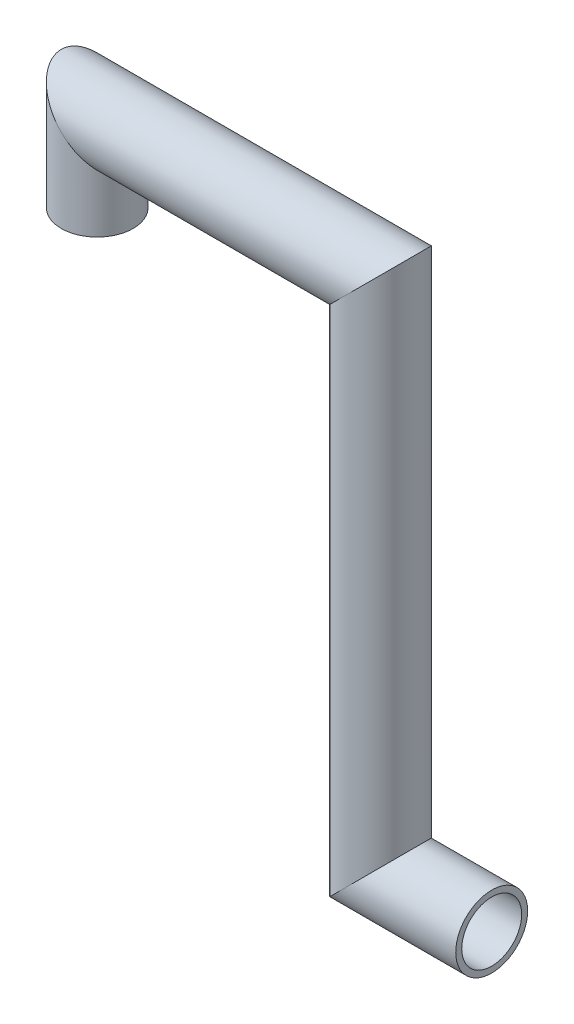
ISO-10303-21;
HEADER;
FILE_DESCRIPTION(('STEP AP214'),'2;1');
FILE_NAME('part.step','',(''),(''),'','','');
FILE_SCHEMA(('AUTOMOTIVE_DESIGN { 1 0 10303 214 1 1 1 1 }'));
ENDSEC;
DATA;
#1=APPLICATION_CONTEXT('core data for automotive mechanical design processes');
#2=APPLICATION_PROTOCOL_DEFINITION('international standard','automotive_design',2000,#1);
#3=PRODUCT_CONTEXT('',#1,'mechanical');
#4=PRODUCT('Part','Part','',(#3));
#5=PRODUCT_RELATED_PRODUCT_CATEGORY('part','',(#4));
#6=PRODUCT_DEFINITION_FORMATION('','',#4);
#7=PRODUCT_DEFINITION_CONTEXT('part definition',#1,'design');
#8=PRODUCT_DEFINITION('design','',#6,#7);
#9=PRODUCT_DEFINITION_SHAPE('','',#8);
#10=(LENGTH_UNIT() NAMED_UNIT(*) SI_UNIT(.MILLI.,.METRE.));
#11=(NAMED_UNIT(*) PLANE_ANGLE_UNIT() SI_UNIT($,.RADIAN.));
#12=(NAMED_UNIT(*) SI_UNIT($,.STERADIAN.) SOLID_ANGLE_UNIT());
#13=UNCERTAINTY_MEASURE_WITH_UNIT(LENGTH_MEASURE(1.E-05),#10,'distance_accuracy_value','');
#14=(GEOMETRIC_REPRESENTATION_CONTEXT(3) GLOBAL_UNCERTAINTY_ASSIGNED_CONTEXT((#13)) GLOBAL_UNIT_ASSIGNED_CONTEXT((#10,
#11,#12)) REPRESENTATION_CONTEXT('',''));
#15=CARTESIAN_POINT('',(0.,0.,0.));
#16=DIRECTION('',(0.,0.,1.));
#17=DIRECTION('',(1.,0.,0.));
#18=AXIS2_PLACEMENT_3D('',#15,#16,#17);
#19=CARTESIAN_POINT('',(329.07398360646,-410.327817432768,0.));
#20=DIRECTION('',(1.,0.,0.));
#21=DIRECTION('',(0.,0.,1.));
#22=AXIS2_PLACEMENT_3D('',#19,#20,#21);
#23=PLANE('',#22);
#24=CARTESIAN_POINT('',(329.07398360646,-410.327817432768,0.));
#25=DIRECTION('',(1.,0.,0.));
#26=DIRECTION('',(0.,1.,0.));
#27=AXIS2_PLACEMENT_3D('',#24,#25,#26);
#28=CIRCLE('',#27,50.);
#29=CARTESIAN_POINT('',(329.07398360646,-360.327817432768,0.));
#30=VERTEX_POINT('',#29);
#31=EDGE_CURVE('E69',#30,#30,#28,.T.);
#32=ORIENTED_EDGE('',*,*,#31,.F.);
#33=EDGE_LOOP('',(#32));
#34=FACE_BOUND('',#33,.T.);
#35=CARTESIAN_POINT('',(329.07398360646,-410.327817432768,0.));
#36=DIRECTION('',(1.,0.,0.));
#37=DIRECTION('',(0.,0.,1.));
#38=AXIS2_PLACEMENT_3D('',#35,#36,#37);
#39=CIRCLE('',#38,60.);
#40=CARTESIAN_POINT('',(329.07398360646,-410.327817432768,60.));
#41=VERTEX_POINT('',#40);
#42=EDGE_CURVE('E37',#41,#41,#39,.T.);
#43=ORIENTED_EDGE('',*,*,#42,.T.);
#44=EDGE_LOOP('',(#43));
#45=FACE_BOUND('',#44,.T.);
#46=ADVANCED_FACE('F34',(#34,#45),#23,.T.);
#47=CARTESIAN_POINT('',(-329.07398360646,306.407118431093,0.));
#48=DIRECTION('',(0.,1.,0.));
#49=DIRECTION('',(0.,0.,1.));
#50=AXIS2_PLACEMENT_3D('',#47,#48,#49);
#51=PLANE('',#50);
#52=CARTESIAN_POINT('',(-329.07398360646,306.407118431093,0.));
#53=DIRECTION('',(0.,1.,0.));
#54=DIRECTION('',(0.,0.,1.));
#55=AXIS2_PLACEMENT_3D('',#52,#53,#54);
#56=CIRCLE('',#55,50.);
#57=CARTESIAN_POINT('',(-329.07398360646,306.407118431093,50.));
#58=VERTEX_POINT('',#57);
#59=EDGE_CURVE('E60',#58,#58,#56,.T.);
#60=ORIENTED_EDGE('',*,*,#59,.T.);
#61=EDGE_LOOP('',(#60));
#62=FACE_BOUND('',#61,.T.);
#63=CARTESIAN_POINT('',(-329.07398360646,306.407118431093,0.));
#64=DIRECTION('',(0.,1.,0.));
#65=DIRECTION('',(0.,0.,1.));
#66=AXIS2_PLACEMENT_3D('',#63,#64,#65);
#67=CIRCLE('',#66,60.);
#68=CARTESIAN_POINT('',(-329.07398360646,306.407118431093,60.));
#69=VERTEX_POINT('',#68);
#70=EDGE_CURVE('E41',#69,#69,#67,.T.);
#71=ORIENTED_EDGE('',*,*,#70,.F.);
#72=EDGE_LOOP('',(#71));
#73=FACE_BOUND('',#72,.T.);
#74=ADVANCED_FACE('F114',(#62,#73),#51,.F.);
#75=CARTESIAN_POINT('',(11.5099085216127,-410.327817432768,0.));
#76=DIRECTION('',(1.,0.,0.));
#77=DIRECTION('',(0.,0.,-1.));
#78=AXIS2_PLACEMENT_3D('',#75,#76,#77);
#79=CYLINDRICAL_SURFACE('',#78,60.);
#80=CARTESIAN_POINT('',(143.609908521613,-410.327817432769,0.));
#81=DIRECTION('',(0.707106781186548,-0.707106781186547,0.));
#82=DIRECTION('',(-0.707106781186547,-0.707106781186548,0.));
#83=AXIS2_PLACEMENT_3D('',#80,#81,#82);
#84=ELLIPSE('',#83,84.8528137423857,60.);
#85=CARTESIAN_POINT('',(83.6099085216126,-470.327817432769,0.));
#86=VERTEX_POINT('',#85);
#87=EDGE_CURVE('E51',#86,#86,#84,.F.);
#88=ORIENTED_EDGE('',*,*,#87,.F.);
#89=EDGE_LOOP('',(#88));
#90=FACE_BOUND('',#89,.T.);
#91=ORIENTED_EDGE('',*,*,#42,.F.);
#92=EDGE_LOOP('',(#91));
#93=FACE_BOUND('',#92,.T.);
#94=ADVANCED_FACE('F111',(#90,#93),#79,.T.);
#95=CARTESIAN_POINT('',(143.609908521612,577.427817432768,0.));
#96=DIRECTION('',(0.,-1.,0.));
#97=DIRECTION('',(1.,0.,0.));
#98=AXIS2_PLACEMENT_3D('',#95,#96,#97);
#99=CYLINDRICAL_SURFACE('',#98,60.);
#100=CARTESIAN_POINT('',(143.609908521612,445.327817432768,0.));
#101=DIRECTION('',(0.707106781186548,-0.707106781186547,0.));
#102=DIRECTION('',(0.707106781186547,0.707106781186548,0.));
#103=AXIS2_PLACEMENT_3D('',#100,#101,#102);
#104=ELLIPSE('',#103,84.8528137423857,60.);
#105=CARTESIAN_POINT('',(203.609908521612,505.327817432768,0.));
#106=VERTEX_POINT('',#105);
#107=EDGE_CURVE('E46',#106,#106,#104,.F.);
#108=ORIENTED_EDGE('',*,*,#107,.F.);
#109=EDGE_LOOP('',(#108));
#110=FACE_BOUND('',#109,.T.);
#111=ORIENTED_EDGE('',*,*,#87,.T.);
#112=EDGE_LOOP('',(#111));
#113=FACE_BOUND('',#112,.T.);
#114=ADVANCED_FACE('F105',(#110,#113),#99,.T.);
#115=CARTESIAN_POINT('',(-461.17398360646,445.327817432768,0.));
#116=DIRECTION('',(1.,0.,0.));
#117=DIRECTION('',(0.,0.,-1.));
#118=AXIS2_PLACEMENT_3D('',#115,#116,#117);
#119=CYLINDRICAL_SURFACE('',#118,60.);
#120=CARTESIAN_POINT('',(-329.07398360646,445.327817432768,0.));
#121=DIRECTION('',(0.707106781186547,0.707106781186547,0.));
#122=DIRECTION('',(-0.707106781186548,0.707106781186548,0.));
#123=AXIS2_PLACEMENT_3D('',#120,#121,#122);
#124=ELLIPSE('',#123,84.8528137423857,60.);
#125=CARTESIAN_POINT('',(-389.07398360646,505.327817432768,0.));
#126=VERTEX_POINT('',#125);
#127=EDGE_CURVE('E10',#126,#126,#124,.F.);
#128=ORIENTED_EDGE('',*,*,#127,.F.);
#129=EDGE_LOOP('',(#128));
#130=FACE_BOUND('',#129,.T.);
#131=ORIENTED_EDGE('',*,*,#107,.T.);
#132=EDGE_LOOP('',(#131));
#133=FACE_BOUND('',#132,.T.);
#134=ADVANCED_FACE('F97',(#130,#133),#119,.T.);
#135=CARTESIAN_POINT('',(-329.07398360646,306.407118431093,0.));
#136=DIRECTION('',(0.,1.,0.));
#137=DIRECTION('',(0.,0.,1.));
#138=AXIS2_PLACEMENT_3D('',#135,#136,#137);
#139=CYLINDRICAL_SURFACE('',#138,60.);
#140=ORIENTED_EDGE('',*,*,#70,.T.);
#141=EDGE_LOOP('',(#140));
#142=FACE_BOUND('',#141,.T.);
#143=ORIENTED_EDGE('',*,*,#127,.T.);
#144=EDGE_LOOP('',(#143));
#145=FACE_BOUND('',#144,.T.);
#146=ADVANCED_FACE('F95',(#142,#145),#139,.T.);
#147=CARTESIAN_POINT('',(11.5099085216127,-410.327817432768,0.));
#148=DIRECTION('',(1.,0.,0.));
#149=DIRECTION('',(0.,0.,-1.));
#150=AXIS2_PLACEMENT_3D('',#147,#148,#149);
#151=CYLINDRICAL_SURFACE('',#150,50.);
#152=CARTESIAN_POINT('',(143.609908521613,-410.327817432768,0.));
#153=DIRECTION('',(0.707106781186548,-0.707106781186547,0.));
#154=DIRECTION('',(-0.707106781186547,-0.707106781186548,0.));
#155=AXIS2_PLACEMENT_3D('',#152,#153,#154);
#156=ELLIPSE('',#155,70.7106781186547,50.);
#157=CARTESIAN_POINT('',(93.6099085216126,-460.327817432768,0.));
#158=VERTEX_POINT('',#157);
#159=EDGE_CURVE('E71',#158,#158,#156,.F.);
#160=ORIENTED_EDGE('',*,*,#159,.T.);
#161=EDGE_LOOP('',(#160));
#162=FACE_BOUND('',#161,.T.);
#163=ORIENTED_EDGE('',*,*,#31,.T.);
#164=EDGE_LOOP('',(#163));
#165=FACE_BOUND('',#164,.T.);
#166=ADVANCED_FACE('F93',(#162,#165),#151,.F.);
#167=CARTESIAN_POINT('',(143.609908521612,577.427817432768,0.));
#168=DIRECTION('',(0.,-1.,0.));
#169=DIRECTION('',(1.,0.,0.));
#170=AXIS2_PLACEMENT_3D('',#167,#168,#169);
#171=CYLINDRICAL_SURFACE('',#170,50.);
#172=CARTESIAN_POINT('',(143.609908521612,445.327817432768,0.));
#173=DIRECTION('',(0.707106781186548,-0.707106781186547,0.));
#174=DIRECTION('',(0.707106781186547,0.707106781186548,0.));
#175=AXIS2_PLACEMENT_3D('',#172,#173,#174);
#176=ELLIPSE('',#175,70.7106781186547,50.);
#177=CARTESIAN_POINT('',(193.609908521612,495.327817432768,0.));
#178=VERTEX_POINT('',#177);
#179=EDGE_CURVE('E65',#178,#178,#176,.F.);
#180=ORIENTED_EDGE('',*,*,#179,.T.);
#181=EDGE_LOOP('',(#180));
#182=FACE_BOUND('',#181,.T.);
#183=ORIENTED_EDGE('',*,*,#159,.F.);
#184=EDGE_LOOP('',(#183));
#185=FACE_BOUND('',#184,.T.);
#186=ADVANCED_FACE('F80',(#182,#185),#171,.F.);
#187=CARTESIAN_POINT('',(-461.17398360646,445.327817432768,0.));
#188=DIRECTION('',(1.,0.,0.));
#189=DIRECTION('',(0.,0.,-1.));
#190=AXIS2_PLACEMENT_3D('',#187,#188,#189);
#191=CYLINDRICAL_SURFACE('',#190,50.);
#192=CARTESIAN_POINT('',(-329.07398360646,445.327817432768,0.));
#193=DIRECTION('',(0.707106781186547,0.707106781186547,0.));
#194=DIRECTION('',(-0.707106781186547,0.707106781186547,0.));
#195=AXIS2_PLACEMENT_3D('',#192,#193,#194);
#196=ELLIPSE('',#195,70.7106781186547,50.);
#197=CARTESIAN_POINT('',(-379.07398360646,495.327817432768,0.));
#198=VERTEX_POINT('',#197);
#199=EDGE_CURVE('E56',#198,#198,#196,.F.);
#200=ORIENTED_EDGE('',*,*,#199,.T.);
#201=EDGE_LOOP('',(#200));
#202=FACE_BOUND('',#201,.T.);
#203=ORIENTED_EDGE('',*,*,#179,.F.);
#204=EDGE_LOOP('',(#203));
#205=FACE_BOUND('',#204,.T.);
#206=ADVANCED_FACE('F83',(#202,#205),#191,.F.);
#207=CARTESIAN_POINT('',(-329.07398360646,306.407118431093,0.));
#208=DIRECTION('',(0.,1.,0.));
#209=DIRECTION('',(0.,0.,1.));
#210=AXIS2_PLACEMENT_3D('',#207,#208,#209);
#211=CYLINDRICAL_SURFACE('',#210,50.);
#212=ORIENTED_EDGE('',*,*,#59,.F.);
#213=EDGE_LOOP('',(#212));
#214=FACE_BOUND('',#213,.T.);
#215=ORIENTED_EDGE('',*,*,#199,.F.);
#216=EDGE_LOOP('',(#215));
#217=FACE_BOUND('',#216,.T.);
#218=ADVANCED_FACE('F85',(#214,#217),#211,.F.);
#219=CLOSED_SHELL('',(#46,#74,#94,#114,#134,#146,#166,#186,#206,#218));
#220=MANIFOLD_SOLID_BREP('B2',#219);
#221=ADVANCED_BREP_SHAPE_REPRESENTATION('',(#18,#220),#14);
#222=SHAPE_DEFINITION_REPRESENTATION(#9,#221);
ENDSEC;
END-ISO-10303-21;
